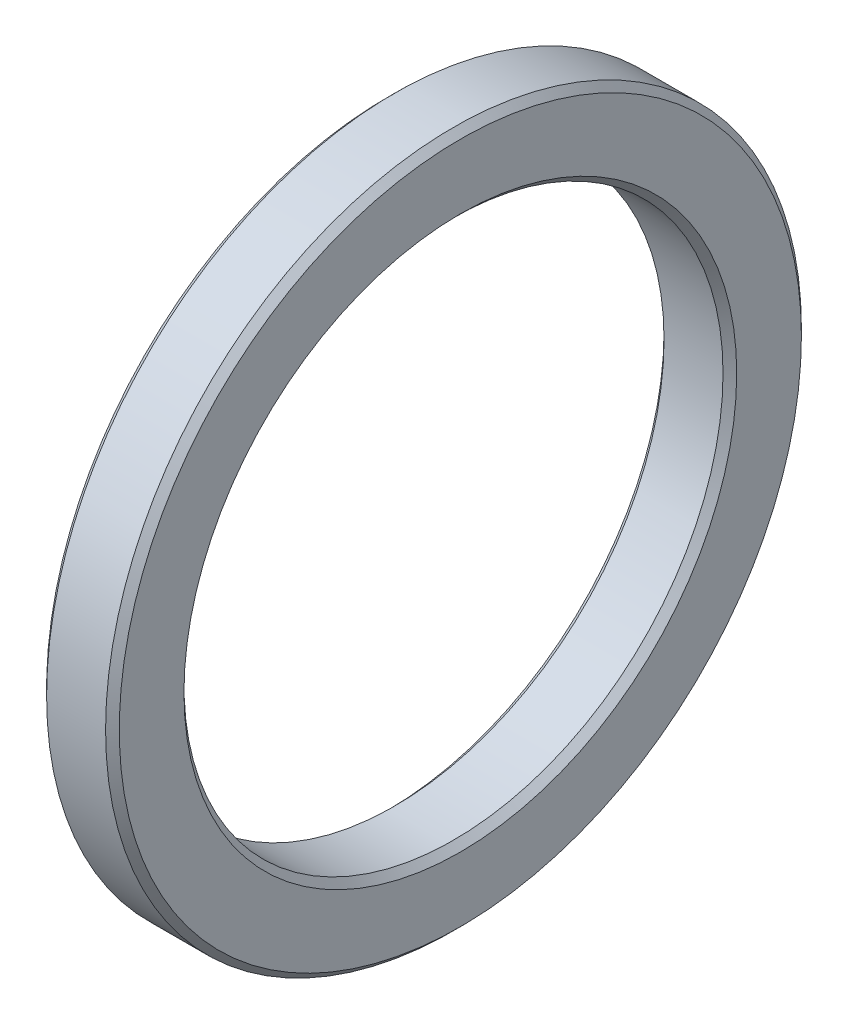
ISO-10303-21;
HEADER;
FILE_DESCRIPTION(('STEP AP214'),'2;1');
FILE_NAME('part.step','',(''),(''),'','','');
FILE_SCHEMA(('AUTOMOTIVE_DESIGN { 1 0 10303 214 1 1 1 1 }'));
ENDSEC;
DATA;
#1=APPLICATION_CONTEXT('core data for automotive mechanical design processes');
#2=APPLICATION_PROTOCOL_DEFINITION('international standard','automotive_design',2000,#1);
#3=PRODUCT_CONTEXT('',#1,'mechanical');
#4=PRODUCT('Part','Part','',(#3));
#5=PRODUCT_RELATED_PRODUCT_CATEGORY('part','',(#4));
#6=PRODUCT_DEFINITION_FORMATION('','',#4);
#7=PRODUCT_DEFINITION_CONTEXT('part definition',#1,'design');
#8=PRODUCT_DEFINITION('design','',#6,#7);
#9=PRODUCT_DEFINITION_SHAPE('','',#8);
#10=(LENGTH_UNIT() NAMED_UNIT(*) SI_UNIT(.MILLI.,.METRE.));
#11=(NAMED_UNIT(*) PLANE_ANGLE_UNIT() SI_UNIT($,.RADIAN.));
#12=(NAMED_UNIT(*) SI_UNIT($,.STERADIAN.) SOLID_ANGLE_UNIT());
#13=UNCERTAINTY_MEASURE_WITH_UNIT(LENGTH_MEASURE(1.E-05),#10,'distance_accuracy_value','');
#14=(GEOMETRIC_REPRESENTATION_CONTEXT(3) GLOBAL_UNCERTAINTY_ASSIGNED_CONTEXT((#13)) GLOBAL_UNIT_ASSIGNED_CONTEXT((#10,
#11,#12)) REPRESENTATION_CONTEXT('',''));
#15=CARTESIAN_POINT('',(0.,0.,0.));
#16=DIRECTION('',(0.,0.,1.));
#17=DIRECTION('',(1.,0.,0.));
#18=AXIS2_PLACEMENT_3D('',#15,#16,#17);
#19=CARTESIAN_POINT('',(6.74,0.,0.));
#20=DIRECTION('',(1.,0.,0.));
#21=DIRECTION('',(0.,0.,-1.));
#22=AXIS2_PLACEMENT_3D('',#19,#20,#21);
#23=PLANE('',#22);
#24=CARTESIAN_POINT('',(6.74,0.,0.));
#25=DIRECTION('',(1.,0.,0.));
#26=DIRECTION('',(0.,0.,-1.));
#27=AXIS2_PLACEMENT_3D('',#24,#25,#26);
#28=CIRCLE('',#27,25.635);
#29=CARTESIAN_POINT('',(6.74,0.,-25.635));
#30=VERTEX_POINT('',#29);
#31=EDGE_CURVE('E10',#30,#30,#28,.F.);
#32=ORIENTED_EDGE('',*,*,#31,.T.);
#33=EDGE_LOOP('',(#32));
#34=FACE_BOUND('',#33,.T.);
#35=CARTESIAN_POINT('',(6.74,0.,0.));
#36=DIRECTION('',(1.,0.,0.));
#37=DIRECTION('',(0.,0.,-1.));
#38=AXIS2_PLACEMENT_3D('',#35,#36,#37);
#39=CIRCLE('',#38,31.635);
#40=CARTESIAN_POINT('',(6.74,0.,-31.635));
#41=VERTEX_POINT('',#40);
#42=EDGE_CURVE('E65',#41,#41,#39,.T.);
#43=ORIENTED_EDGE('',*,*,#42,.T.);
#44=EDGE_LOOP('',(#43));
#45=FACE_BOUND('',#44,.T.);
#46=ADVANCED_FACE('F44',(#34,#45),#23,.T.);
#47=CARTESIAN_POINT('',(0.,0.,0.));
#48=DIRECTION('',(1.,0.,0.));
#49=DIRECTION('',(0.,0.,-1.));
#50=AXIS2_PLACEMENT_3D('',#47,#48,#49);
#51=PLANE('',#50);
#52=CARTESIAN_POINT('',(0.,0.,0.));
#53=DIRECTION('',(1.,0.,0.));
#54=DIRECTION('',(0.,0.,-1.));
#55=AXIS2_PLACEMENT_3D('',#52,#53,#54);
#56=CIRCLE('',#55,25.635);
#57=CARTESIAN_POINT('',(0.,0.,-25.635));
#58=VERTEX_POINT('',#57);
#59=EDGE_CURVE('E60',#58,#58,#56,.T.);
#60=ORIENTED_EDGE('',*,*,#59,.T.);
#61=EDGE_LOOP('',(#60));
#62=FACE_BOUND('',#61,.T.);
#63=CARTESIAN_POINT('',(0.,0.,0.));
#64=DIRECTION('',(1.,0.,0.));
#65=DIRECTION('',(0.,0.,-1.));
#66=AXIS2_PLACEMENT_3D('',#63,#64,#65);
#67=CIRCLE('',#66,31.635);
#68=CARTESIAN_POINT('',(0.,0.,-31.635));
#69=VERTEX_POINT('',#68);
#70=EDGE_CURVE('E68',#69,#69,#67,.F.);
#71=ORIENTED_EDGE('',*,*,#70,.T.);
#72=EDGE_LOOP('',(#71));
#73=FACE_BOUND('',#72,.T.);
#74=ADVANCED_FACE('F89',(#62,#73),#51,.F.);
#75=CARTESIAN_POINT('',(6.74,0.,0.));
#76=DIRECTION('',(-1.,0.,0.));
#77=DIRECTION('',(0.,0.,1.));
#78=AXIS2_PLACEMENT_3D('',#75,#76,#77);
#79=CYLINDRICAL_SURFACE('',#78,32.27);
#80=CARTESIAN_POINT('',(0.634999999999983,0.,0.));
#81=DIRECTION('',(1.,0.,0.));
#82=DIRECTION('',(0.,0.,-1.));
#83=AXIS2_PLACEMENT_3D('',#80,#81,#82);
#84=CIRCLE('',#83,32.27);
#85=CARTESIAN_POINT('',(0.634999999999983,0.,-32.27));
#86=VERTEX_POINT('',#85);
#87=EDGE_CURVE('E71',#86,#86,#84,.T.);
#88=ORIENTED_EDGE('',*,*,#87,.T.);
#89=EDGE_LOOP('',(#88));
#90=FACE_BOUND('',#89,.T.);
#91=CARTESIAN_POINT('',(6.10499999999998,0.,0.));
#92=DIRECTION('',(1.,0.,0.));
#93=DIRECTION('',(0.,0.,-1.));
#94=AXIS2_PLACEMENT_3D('',#91,#92,#93);
#95=CIRCLE('',#94,32.27);
#96=CARTESIAN_POINT('',(6.10499999999998,0.,-32.27));
#97=VERTEX_POINT('',#96);
#98=EDGE_CURVE('E74',#97,#97,#95,.F.);
#99=ORIENTED_EDGE('',*,*,#98,.T.);
#100=EDGE_LOOP('',(#99));
#101=FACE_BOUND('',#100,.T.);
#102=ADVANCED_FACE('F78',(#90,#101),#79,.T.);
#103=CARTESIAN_POINT('',(6.74,0.,0.));
#104=DIRECTION('',(-1.,0.,0.));
#105=DIRECTION('',(0.,0.,1.));
#106=AXIS2_PLACEMENT_3D('',#103,#104,#105);
#107=CYLINDRICAL_SURFACE('',#106,25.);
#108=CARTESIAN_POINT('',(0.63499999999999,0.,0.));
#109=DIRECTION('',(1.,0.,0.));
#110=DIRECTION('',(0.,0.,-1.));
#111=AXIS2_PLACEMENT_3D('',#108,#109,#110);
#112=CIRCLE('',#111,25.);
#113=CARTESIAN_POINT('',(0.63499999999999,0.,-25.));
#114=VERTEX_POINT('',#113);
#115=EDGE_CURVE('E52',#114,#114,#112,.F.);
#116=ORIENTED_EDGE('',*,*,#115,.T.);
#117=EDGE_LOOP('',(#116));
#118=FACE_BOUND('',#117,.T.);
#119=CARTESIAN_POINT('',(6.10499999999999,0.,0.));
#120=DIRECTION('',(1.,0.,0.));
#121=DIRECTION('',(0.,0.,-1.));
#122=AXIS2_PLACEMENT_3D('',#119,#120,#121);
#123=CIRCLE('',#122,25.);
#124=CARTESIAN_POINT('',(6.10499999999999,0.,-25.));
#125=VERTEX_POINT('',#124);
#126=EDGE_CURVE('E56',#125,#125,#123,.T.);
#127=ORIENTED_EDGE('',*,*,#126,.T.);
#128=EDGE_LOOP('',(#127));
#129=FACE_BOUND('',#128,.T.);
#130=ADVANCED_FACE('F97',(#118,#129),#107,.F.);
#131=CARTESIAN_POINT('',(0.634999999999983,0.,0.));
#132=DIRECTION('',(1.,0.,0.));
#133=DIRECTION('',(0.,0.,-1.));
#134=AXIS2_PLACEMENT_3D('',#131,#132,#133);
#135=CONICAL_SURFACE('',#134,32.27,0.785398163397454);
#136=ORIENTED_EDGE('',*,*,#70,.F.);
#137=EDGE_LOOP('',(#136));
#138=FACE_BOUND('',#137,.T.);
#139=ORIENTED_EDGE('',*,*,#87,.F.);
#140=EDGE_LOOP('',(#139));
#141=FACE_BOUND('',#140,.T.);
#142=ADVANCED_FACE('F84',(#138,#141),#135,.T.);
#143=CARTESIAN_POINT('',(6.74,0.,0.));
#144=DIRECTION('',(-1.,0.,0.));
#145=DIRECTION('',(0.,0.,1.));
#146=AXIS2_PLACEMENT_3D('',#143,#144,#145);
#147=CONICAL_SURFACE('',#146,31.635,0.785398163397437);
#148=ORIENTED_EDGE('',*,*,#98,.F.);
#149=EDGE_LOOP('',(#148));
#150=FACE_BOUND('',#149,.T.);
#151=ORIENTED_EDGE('',*,*,#42,.F.);
#152=EDGE_LOOP('',(#151));
#153=FACE_BOUND('',#152,.T.);
#154=ADVANCED_FACE('F80',(#150,#153),#147,.T.);
#155=CARTESIAN_POINT('',(0.,0.,0.));
#156=DIRECTION('',(-1.,0.,0.));
#157=DIRECTION('',(0.,0.,1.));
#158=AXIS2_PLACEMENT_3D('',#155,#156,#157);
#159=CONICAL_SURFACE('',#158,25.635,0.785398163397443);
#160=ORIENTED_EDGE('',*,*,#115,.F.);
#161=EDGE_LOOP('',(#160));
#162=FACE_BOUND('',#161,.T.);
#163=ORIENTED_EDGE('',*,*,#59,.F.);
#164=EDGE_LOOP('',(#163));
#165=FACE_BOUND('',#164,.T.);
#166=ADVANCED_FACE('F83',(#162,#165),#159,.F.);
#167=CARTESIAN_POINT('',(6.10499999999999,0.,0.));
#168=DIRECTION('',(1.,0.,0.));
#169=DIRECTION('',(0.,0.,-1.));
#170=AXIS2_PLACEMENT_3D('',#167,#168,#169);
#171=CONICAL_SURFACE('',#170,25.,0.785398163397443);
#172=ORIENTED_EDGE('',*,*,#31,.F.);
#173=EDGE_LOOP('',(#172));
#174=FACE_BOUND('',#173,.T.);
#175=ORIENTED_EDGE('',*,*,#126,.F.);
#176=EDGE_LOOP('',(#175));
#177=FACE_BOUND('',#176,.T.);
#178=ADVANCED_FACE('F47',(#174,#177),#171,.F.);
#179=CLOSED_SHELL('',(#46,#74,#102,#130,#142,#154,#166,#178));
#180=MANIFOLD_SOLID_BREP('B2',#179);
#181=ADVANCED_BREP_SHAPE_REPRESENTATION('',(#18,#180),#14);
#182=SHAPE_DEFINITION_REPRESENTATION(#9,#181);
ENDSEC;
END-ISO-10303-21;
